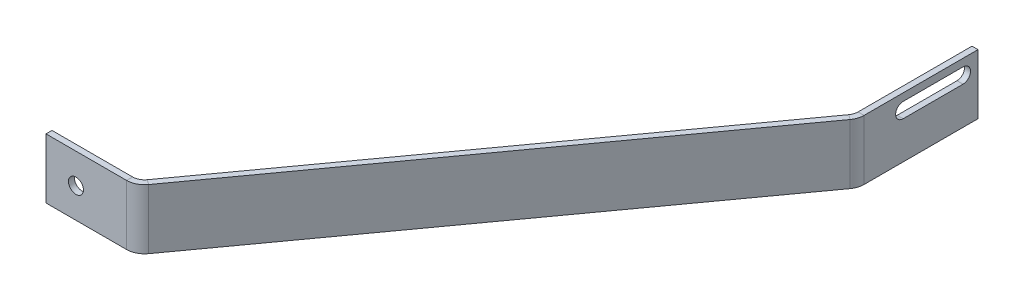
ISO-10303-21;
HEADER;
FILE_DESCRIPTION(('STEP AP214'),'2;1');
FILE_NAME('part.step','',(''),(''),'','','');
FILE_SCHEMA(('AUTOMOTIVE_DESIGN { 1 0 10303 214 1 1 1 1 }'));
ENDSEC;
DATA;
#1=APPLICATION_CONTEXT('core data for automotive mechanical design processes');
#2=APPLICATION_PROTOCOL_DEFINITION('international standard','automotive_design',2000,#1);
#3=PRODUCT_CONTEXT('',#1,'mechanical');
#4=PRODUCT('Part','Part','',(#3));
#5=PRODUCT_RELATED_PRODUCT_CATEGORY('part','',(#4));
#6=PRODUCT_DEFINITION_FORMATION('','',#4);
#7=PRODUCT_DEFINITION_CONTEXT('part definition',#1,'design');
#8=PRODUCT_DEFINITION('design','',#6,#7);
#9=PRODUCT_DEFINITION_SHAPE('','',#8);
#10=(LENGTH_UNIT() NAMED_UNIT(*) SI_UNIT(.MILLI.,.METRE.));
#11=(NAMED_UNIT(*) PLANE_ANGLE_UNIT() SI_UNIT($,.RADIAN.));
#12=(NAMED_UNIT(*) SI_UNIT($,.STERADIAN.) SOLID_ANGLE_UNIT());
#13=UNCERTAINTY_MEASURE_WITH_UNIT(LENGTH_MEASURE(1.E-05),#10,'distance_accuracy_value','');
#14=(GEOMETRIC_REPRESENTATION_CONTEXT(3) GLOBAL_UNCERTAINTY_ASSIGNED_CONTEXT((#13)) GLOBAL_UNIT_ASSIGNED_CONTEXT((#10,
#11,#12)) REPRESENTATION_CONTEXT('',''));
#15=CARTESIAN_POINT('',(0.,0.,0.));
#16=DIRECTION('',(0.,0.,1.));
#17=DIRECTION('',(1.,0.,0.));
#18=AXIS2_PLACEMENT_3D('',#15,#16,#17);
#19=CARTESIAN_POINT('',(131.25,20.,-140.));
#20=DIRECTION('',(-1.,0.,0.));
#21=DIRECTION('',(0.,0.,1.));
#22=AXIS2_PLACEMENT_3D('',#19,#20,#21);
#23=PLANE('',#22);
#24=DIRECTION('',(0.,0.,-1.));
#25=VECTOR('',#24,1.);
#26=CARTESIAN_POINT('',(131.25,20.,-140.));
#27=LINE('',#26,#25);
#28=CARTESIAN_POINT('',(131.25,20.,-141.94228428091));
#29=VERTEX_POINT('',#28);
#30=CARTESIAN_POINT('',(131.25,20.,-180.));
#31=VERTEX_POINT('',#30);
#32=EDGE_CURVE('E228',#29,#31,#27,.T.);
#33=ORIENTED_EDGE('',*,*,#32,.F.);
#34=DIRECTION('',(0.,-1.,0.));
#35=VECTOR('',#34,1.);
#36=CARTESIAN_POINT('',(131.25,20.,-141.94228428091));
#37=LINE('',#36,#35);
#38=CARTESIAN_POINT('',(131.25,0.,-141.94228428091));
#39=VERTEX_POINT('',#38);
#40=EDGE_CURVE('E240',#29,#39,#37,.T.);
#41=ORIENTED_EDGE('',*,*,#40,.T.);
#42=DIRECTION('',(0.,0.,-1.));
#43=VECTOR('',#42,1.);
#44=CARTESIAN_POINT('',(131.25,0.,-140.));
#45=LINE('',#44,#43);
#46=CARTESIAN_POINT('',(131.25,0.,-180.));
#47=VERTEX_POINT('',#46);
#48=EDGE_CURVE('E220',#39,#47,#45,.T.);
#49=ORIENTED_EDGE('',*,*,#48,.T.);
#50=DIRECTION('',(0.,-1.,0.));
#51=VECTOR('',#50,1.);
#52=CARTESIAN_POINT('',(131.25,20.,-180.));
#53=LINE('',#52,#51);
#54=EDGE_CURVE('E224',#31,#47,#53,.T.);
#55=ORIENTED_EDGE('',*,*,#54,.F.);
#56=EDGE_LOOP('',(#33,#41,#49,#55));
#57=FACE_BOUND('',#56,.T.);
#58=CARTESIAN_POINT('',(131.25,15.,-175.));
#59=DIRECTION('',(-1.,0.,0.));
#60=DIRECTION('',(0.,0.,1.));
#61=AXIS2_PLACEMENT_3D('',#58,#59,#60);
#62=CIRCLE('',#61,2.5);
#63=CARTESIAN_POINT('',(131.25,17.5,-175.));
#64=VERTEX_POINT('',#63);
#65=CARTESIAN_POINT('',(131.25,12.5,-175.));
#66=VERTEX_POINT('',#65);
#67=EDGE_CURVE('E63',#64,#66,#62,.T.);
#68=ORIENTED_EDGE('',*,*,#67,.T.);
#69=DIRECTION('',(0.,0.,1.));
#70=VECTOR('',#69,1.);
#71=CARTESIAN_POINT('',(131.25,12.5,-175.));
#72=LINE('',#71,#70);
#73=CARTESIAN_POINT('',(131.25,12.5,-155.));
#74=VERTEX_POINT('',#73);
#75=EDGE_CURVE('E170',#66,#74,#72,.T.);
#76=ORIENTED_EDGE('',*,*,#75,.T.);
#77=CARTESIAN_POINT('',(131.25,15.,-155.));
#78=DIRECTION('',(-1.,0.,0.));
#79=DIRECTION('',(0.,0.,1.));
#80=AXIS2_PLACEMENT_3D('',#77,#78,#79);
#81=CIRCLE('',#80,2.5);
#82=CARTESIAN_POINT('',(131.25,17.5,-155.));
#83=VERTEX_POINT('',#82);
#84=EDGE_CURVE('E177',#74,#83,#81,.T.);
#85=ORIENTED_EDGE('',*,*,#84,.T.);
#86=DIRECTION('',(0.,0.,-1.));
#87=VECTOR('',#86,1.);
#88=CARTESIAN_POINT('',(131.25,17.5,-175.));
#89=LINE('',#88,#87);
#90=EDGE_CURVE('E180',#83,#64,#89,.T.);
#91=ORIENTED_EDGE('',*,*,#90,.T.);
#92=EDGE_LOOP('',(#68,#76,#85,#91));
#93=FACE_BOUND('',#92,.T.);
#94=ADVANCED_FACE('F47',(#57,#93),#23,.F.);
#95=CARTESIAN_POINT('',(129.25,20.,-140.));
#96=DIRECTION('',(-1.,0.,0.));
#97=DIRECTION('',(0.,0.,1.));
#98=AXIS2_PLACEMENT_3D('',#95,#96,#97);
#99=PLANE('',#98);
#100=DIRECTION('',(0.,0.,1.));
#101=VECTOR('',#100,1.);
#102=CARTESIAN_POINT('',(129.25,20.,-140.));
#103=LINE('',#102,#101);
#104=CARTESIAN_POINT('',(129.25,20.,-141.94228428091));
#105=VERTEX_POINT('',#104);
#106=CARTESIAN_POINT('',(129.25,20.,-180.));
#107=VERTEX_POINT('',#106);
#108=EDGE_CURVE('E277',#105,#107,#103,.F.);
#109=ORIENTED_EDGE('',*,*,#108,.T.);
#110=DIRECTION('',(0.,1.,0.));
#111=VECTOR('',#110,1.);
#112=CARTESIAN_POINT('',(129.25,20.,-180.));
#113=LINE('',#112,#111);
#114=CARTESIAN_POINT('',(129.25,0.,-180.));
#115=VERTEX_POINT('',#114);
#116=EDGE_CURVE('E284',#107,#115,#113,.F.);
#117=ORIENTED_EDGE('',*,*,#116,.T.);
#118=DIRECTION('',(0.,0.,1.));
#119=VECTOR('',#118,1.);
#120=CARTESIAN_POINT('',(129.25,0.,-140.));
#121=LINE('',#120,#119);
#122=CARTESIAN_POINT('',(129.25,0.,-141.94228428091));
#123=VERTEX_POINT('',#122);
#124=EDGE_CURVE('E288',#123,#115,#121,.F.);
#125=ORIENTED_EDGE('',*,*,#124,.F.);
#126=DIRECTION('',(0.,1.,0.));
#127=VECTOR('',#126,1.);
#128=CARTESIAN_POINT('',(129.25,20.,-141.94228428091));
#129=LINE('',#128,#127);
#130=EDGE_CURVE('E265',#105,#123,#129,.F.);
#131=ORIENTED_EDGE('',*,*,#130,.F.);
#132=EDGE_LOOP('',(#109,#117,#125,#131));
#133=FACE_BOUND('',#132,.T.);
#134=DIRECTION('',(0.,0.,-1.));
#135=VECTOR('',#134,1.);
#136=CARTESIAN_POINT('',(129.25,12.5,-140.));
#137=LINE('',#136,#135);
#138=CARTESIAN_POINT('',(129.25,12.5,-155.));
#139=VERTEX_POINT('',#138);
#140=CARTESIAN_POINT('',(129.25,12.5,-175.));
#141=VERTEX_POINT('',#140);
#142=EDGE_CURVE('E56',#139,#141,#137,.T.);
#143=ORIENTED_EDGE('',*,*,#142,.T.);
#144=CARTESIAN_POINT('',(129.25,15.,-175.));
#145=DIRECTION('',(-1.,0.,0.));
#146=DIRECTION('',(0.,0.,1.));
#147=AXIS2_PLACEMENT_3D('',#144,#145,#146);
#148=CIRCLE('',#147,2.5);
#149=CARTESIAN_POINT('',(129.25,17.5,-175.));
#150=VERTEX_POINT('',#149);
#151=EDGE_CURVE('E11',#141,#150,#148,.F.);
#152=ORIENTED_EDGE('',*,*,#151,.T.);
#153=DIRECTION('',(0.,0.,1.));
#154=VECTOR('',#153,1.);
#155=CARTESIAN_POINT('',(129.25,17.5,-140.));
#156=LINE('',#155,#154);
#157=CARTESIAN_POINT('',(129.25,17.5,-155.));
#158=VERTEX_POINT('',#157);
#159=EDGE_CURVE('E361',#150,#158,#156,.T.);
#160=ORIENTED_EDGE('',*,*,#159,.T.);
#161=CARTESIAN_POINT('',(129.25,15.,-155.));
#162=DIRECTION('',(-1.,0.,0.));
#163=DIRECTION('',(0.,0.,1.));
#164=AXIS2_PLACEMENT_3D('',#161,#162,#163);
#165=CIRCLE('',#164,2.5);
#166=EDGE_CURVE('E370',#158,#139,#165,.F.);
#167=ORIENTED_EDGE('',*,*,#166,.T.);
#168=EDGE_LOOP('',(#143,#152,#160,#167));
#169=FACE_BOUND('',#168,.T.);
#170=ADVANCED_FACE('F375',(#133,#169),#99,.T.);
#171=CARTESIAN_POINT('',(30.,20.,0.));
#172=DIRECTION('',(0.,1.,0.));
#173=DIRECTION('',(0.586018731283682,0.,-0.810297504984844));
#174=AXIS2_PLACEMENT_3D('',#171,#172,#173);
#175=PLANE('',#174);
#176=DIRECTION('',(0.810297504984844,0.,0.586018731283682));
#177=VECTOR('',#176,1.);
#178=CARTESIAN_POINT('',(130.111785029909,20.,-138.426171893208));
#179=LINE('',#178,#177);
#180=CARTESIAN_POINT('',(128.491190019939,20.,-139.598209355775));
#181=VERTEX_POINT('',#180);
#182=CARTESIAN_POINT('',(130.111785029909,20.,-138.426171893208));
#183=VERTEX_POINT('',#182);
#184=EDGE_CURVE('E358',#181,#183,#179,.T.);
#185=ORIENTED_EDGE('',*,*,#184,.F.);
#186=DIRECTION('',(-0.586018731283682,0.,0.810297504984844));
#187=VECTOR('',#186,1.);
#188=CARTESIAN_POINT('',(28.3794049900303,20.,-1.17203746256736));
#189=LINE('',#188,#187);
#190=CARTESIAN_POINT('',(30.1757879953529,20.,-3.65592507486527));
#191=VERTEX_POINT('',#190);
#192=EDGE_CURVE('E302',#191,#181,#189,.F.);
#193=ORIENTED_EDGE('',*,*,#192,.F.);
#194=DIRECTION('',(0.810297504984844,0.,0.586018731283682));
#195=VECTOR('',#194,1.);
#196=CARTESIAN_POINT('',(31.7963830053226,20.,-2.48388761229791));
#197=LINE('',#196,#195);
#198=CARTESIAN_POINT('',(31.7963830053226,20.,-2.48388761229791));
#199=VERTEX_POINT('',#198);
#200=EDGE_CURVE('E355',#191,#199,#197,.T.);
#201=ORIENTED_EDGE('',*,*,#200,.T.);
#202=DIRECTION('',(0.586018731283682,0.,-0.810297504984844));
#203=VECTOR('',#202,1.);
#204=CARTESIAN_POINT('',(30.,20.,0.));
#205=LINE('',#204,#203);
#206=EDGE_CURVE('E203',#199,#183,#205,.T.);
#207=ORIENTED_EDGE('',*,*,#206,.T.);
#208=EDGE_LOOP('',(#185,#193,#201,#207));
#209=FACE_BOUND('',#208,.T.);
#210=ADVANCED_FACE('F392',(#209),#175,.T.);
#211=CARTESIAN_POINT('',(26.9345979754135,20.,-6.));
#212=DIRECTION('',(0.,-1.,0.));
#213=DIRECTION('',(0.,0.,-1.));
#214=AXIS2_PLACEMENT_3D('',#211,#212,#213);
#215=PLANE('',#214);
#216=ORIENTED_EDGE('',*,*,#200,.F.);
#217=CARTESIAN_POINT('',(26.9345979754135,20.,-6.));
#218=DIRECTION('',(0.,-1.,0.));
#219=DIRECTION('',(0.,0.,-1.));
#220=AXIS2_PLACEMENT_3D('',#217,#218,#219);
#221=CIRCLE('',#220,4.);
#222=CARTESIAN_POINT('',(26.9345979754135,20.,-2.));
#223=VERTEX_POINT('',#222);
#224=EDGE_CURVE('E303',#191,#223,#221,.T.);
#225=ORIENTED_EDGE('',*,*,#224,.T.);
#226=DIRECTION('',(0.,0.,1.));
#227=VECTOR('',#226,1.);
#228=CARTESIAN_POINT('',(26.9345979754135,20.,0.));
#229=LINE('',#228,#227);
#230=CARTESIAN_POINT('',(26.9345979754135,20.,0.));
#231=VERTEX_POINT('',#230);
#232=EDGE_CURVE('E352',#223,#231,#229,.T.);
#233=ORIENTED_EDGE('',*,*,#232,.T.);
#234=CARTESIAN_POINT('',(26.9345979754135,20.,-6.));
#235=DIRECTION('',(0.,1.,0.));
#236=DIRECTION('',(0.,0.,1.));
#237=AXIS2_PLACEMENT_3D('',#234,#235,#236);
#238=CIRCLE('',#237,6.);
#239=EDGE_CURVE('E204',#199,#231,#238,.F.);
#240=ORIENTED_EDGE('',*,*,#239,.F.);
#241=EDGE_LOOP('',(#216,#225,#233,#240));
#242=FACE_BOUND('',#241,.T.);
#243=ADVANCED_FACE('F461',(#242),#215,.F.);
#244=CARTESIAN_POINT('',(0.,20.,0.));
#245=DIRECTION('',(0.,1.,0.));
#246=DIRECTION('',(1.,0.,0.));
#247=AXIS2_PLACEMENT_3D('',#244,#245,#246);
#248=PLANE('',#247);
#249=ORIENTED_EDGE('',*,*,#232,.F.);
#250=DIRECTION('',(-1.,0.,0.));
#251=VECTOR('',#250,1.);
#252=CARTESIAN_POINT('',(0.,20.,-2.));
#253=LINE('',#252,#251);
#254=CARTESIAN_POINT('',(0.,20.,-2.));
#255=VERTEX_POINT('',#254);
#256=EDGE_CURVE('E312',#255,#223,#253,.F.);
#257=ORIENTED_EDGE('',*,*,#256,.F.);
#258=DIRECTION('',(0.,0.,1.));
#259=VECTOR('',#258,1.);
#260=CARTESIAN_POINT('',(0.,20.,0.));
#261=LINE('',#260,#259);
#262=CARTESIAN_POINT('',(0.,20.,0.));
#263=VERTEX_POINT('',#262);
#264=EDGE_CURVE('E349',#255,#263,#261,.T.);
#265=ORIENTED_EDGE('',*,*,#264,.T.);
#266=DIRECTION('',(1.,0.,0.));
#267=VECTOR('',#266,1.);
#268=CARTESIAN_POINT('',(0.,20.,0.));
#269=LINE('',#268,#267);
#270=EDGE_CURVE('E212',#263,#231,#269,.T.);
#271=ORIENTED_EDGE('',*,*,#270,.T.);
#272=EDGE_LOOP('',(#249,#257,#265,#271));
#273=FACE_BOUND('',#272,.T.);
#274=ADVANCED_FACE('F457',(#273),#248,.T.);
#275=CARTESIAN_POINT('',(0.,20.,0.));
#276=DIRECTION('',(1.,0.,0.));
#277=DIRECTION('',(0.,-1.,0.));
#278=AXIS2_PLACEMENT_3D('',#275,#276,#277);
#279=PLANE('',#278);
#280=ORIENTED_EDGE('',*,*,#264,.F.);
#281=DIRECTION('',(0.,1.,0.));
#282=VECTOR('',#281,1.);
#283=CARTESIAN_POINT('',(0.,20.,-2.));
#284=LINE('',#283,#282);
#285=CARTESIAN_POINT('',(0.,0.,-2.));
#286=VERTEX_POINT('',#285);
#287=EDGE_CURVE('E292',#255,#286,#284,.F.);
#288=ORIENTED_EDGE('',*,*,#287,.T.);
#289=DIRECTION('',(0.,0.,1.));
#290=VECTOR('',#289,1.);
#291=CARTESIAN_POINT('',(0.,0.,0.));
#292=LINE('',#291,#290);
#293=CARTESIAN_POINT('',(0.,0.,0.));
#294=VERTEX_POINT('',#293);
#295=EDGE_CURVE('E346',#286,#294,#292,.T.);
#296=ORIENTED_EDGE('',*,*,#295,.T.);
#297=DIRECTION('',(0.,-1.,0.));
#298=VECTOR('',#297,1.);
#299=CARTESIAN_POINT('',(0.,20.,0.));
#300=LINE('',#299,#298);
#301=EDGE_CURVE('E216',#263,#294,#300,.T.);
#302=ORIENTED_EDGE('',*,*,#301,.F.);
#303=EDGE_LOOP('',(#280,#288,#296,#302));
#304=FACE_BOUND('',#303,.T.);
#305=ADVANCED_FACE('F453',(#304),#279,.F.);
#306=CARTESIAN_POINT('',(0.,0.,0.));
#307=DIRECTION('',(0.,1.,0.));
#308=DIRECTION('',(1.,0.,0.));
#309=AXIS2_PLACEMENT_3D('',#306,#307,#308);
#310=PLANE('',#309);
#311=ORIENTED_EDGE('',*,*,#295,.F.);
#312=DIRECTION('',(-1.,0.,0.));
#313=VECTOR('',#312,1.);
#314=CARTESIAN_POINT('',(0.,0.,-2.));
#315=LINE('',#314,#313);
#316=CARTESIAN_POINT('',(26.9345979754135,0.,-2.));
#317=VERTEX_POINT('',#316);
#318=EDGE_CURVE('E308',#286,#317,#315,.F.);
#319=ORIENTED_EDGE('',*,*,#318,.T.);
#320=DIRECTION('',(0.,0.,1.));
#321=VECTOR('',#320,1.);
#322=CARTESIAN_POINT('',(26.9345979754135,0.,0.));
#323=LINE('',#322,#321);
#324=CARTESIAN_POINT('',(26.9345979754135,0.,0.));
#325=VERTEX_POINT('',#324);
#326=EDGE_CURVE('E343',#317,#325,#323,.T.);
#327=ORIENTED_EDGE('',*,*,#326,.T.);
#328=DIRECTION('',(1.,0.,0.));
#329=VECTOR('',#328,1.);
#330=CARTESIAN_POINT('',(0.,0.,0.));
#331=LINE('',#330,#329);
#332=EDGE_CURVE('E208',#294,#325,#331,.T.);
#333=ORIENTED_EDGE('',*,*,#332,.F.);
#334=EDGE_LOOP('',(#311,#319,#327,#333));
#335=FACE_BOUND('',#334,.T.);
#336=ADVANCED_FACE('F449',(#335),#310,.F.);
#337=CARTESIAN_POINT('',(26.9345979754135,0.,-6.));
#338=DIRECTION('',(0.,1.,0.));
#339=DIRECTION('',(0.,0.,1.));
#340=AXIS2_PLACEMENT_3D('',#337,#338,#339);
#341=PLANE('',#340);
#342=ORIENTED_EDGE('',*,*,#326,.F.);
#343=CARTESIAN_POINT('',(26.9345979754135,0.,-6.));
#344=DIRECTION('',(0.,-1.,0.));
#345=DIRECTION('',(0.,0.,-1.));
#346=AXIS2_PLACEMENT_3D('',#343,#344,#345);
#347=CIRCLE('',#346,4.);
#348=CARTESIAN_POINT('',(30.1757879953529,0.,-3.65592507486527));
#349=VERTEX_POINT('',#348);
#350=EDGE_CURVE('E304',#317,#349,#347,.F.);
#351=ORIENTED_EDGE('',*,*,#350,.T.);
#352=DIRECTION('',(0.810297504984844,0.,0.586018731283682));
#353=VECTOR('',#352,1.);
#354=CARTESIAN_POINT('',(31.7963830053226,0.,-2.48388761229791));
#355=LINE('',#354,#353);
#356=CARTESIAN_POINT('',(31.7963830053226,0.,-2.48388761229791));
#357=VERTEX_POINT('',#356);
#358=EDGE_CURVE('E340',#349,#357,#355,.T.);
#359=ORIENTED_EDGE('',*,*,#358,.T.);
#360=CARTESIAN_POINT('',(26.9345979754135,0.,-6.));
#361=DIRECTION('',(0.,-1.,0.));
#362=DIRECTION('',(0.,0.,-1.));
#363=AXIS2_PLACEMENT_3D('',#360,#361,#362);
#364=CIRCLE('',#363,6.);
#365=EDGE_CURVE('E241',#325,#357,#364,.F.);
#366=ORIENTED_EDGE('',*,*,#365,.F.);
#367=EDGE_LOOP('',(#342,#351,#359,#366));
#368=FACE_BOUND('',#367,.T.);
#369=ADVANCED_FACE('F445',(#368),#341,.F.);
#370=CARTESIAN_POINT('',(30.,0.,0.));
#371=DIRECTION('',(0.,1.,0.));
#372=DIRECTION('',(0.586018731283682,0.,-0.810297504984844));
#373=AXIS2_PLACEMENT_3D('',#370,#371,#372);
#374=PLANE('',#373);
#375=ORIENTED_EDGE('',*,*,#358,.F.);
#376=DIRECTION('',(-0.586018731283682,0.,0.810297504984844));
#377=VECTOR('',#376,1.);
#378=CARTESIAN_POINT('',(28.3794049900303,0.,-1.17203746256736));
#379=LINE('',#378,#377);
#380=CARTESIAN_POINT('',(128.491190019939,0.,-139.598209355775));
#381=VERTEX_POINT('',#380);
#382=EDGE_CURVE('E298',#349,#381,#379,.F.);
#383=ORIENTED_EDGE('',*,*,#382,.T.);
#384=DIRECTION('',(0.810297504984846,0.,0.586018731283679));
#385=VECTOR('',#384,1.);
#386=CARTESIAN_POINT('',(130.111785029909,0.,-138.426171893208));
#387=LINE('',#386,#385);
#388=CARTESIAN_POINT('',(130.111785029909,0.,-138.426171893208));
#389=VERTEX_POINT('',#388);
#390=EDGE_CURVE('E337',#381,#389,#387,.T.);
#391=ORIENTED_EDGE('',*,*,#390,.T.);
#392=DIRECTION('',(0.586018731283682,0.,-0.810297504984844));
#393=VECTOR('',#392,1.);
#394=CARTESIAN_POINT('',(30.,0.,0.));
#395=LINE('',#394,#393);
#396=EDGE_CURVE('E199',#357,#389,#395,.T.);
#397=ORIENTED_EDGE('',*,*,#396,.F.);
#398=EDGE_LOOP('',(#375,#383,#391,#397));
#399=FACE_BOUND('',#398,.T.);
#400=ADVANCED_FACE('F441',(#399),#374,.F.);
#401=CARTESIAN_POINT('',(125.25,0.,-141.94228428091));
#402=DIRECTION('',(0.,1.,0.));
#403=DIRECTION('',(0.,0.,1.));
#404=AXIS2_PLACEMENT_3D('',#401,#402,#403);
#405=PLANE('',#404);
#406=ORIENTED_EDGE('',*,*,#390,.F.);
#407=CARTESIAN_POINT('',(125.25,0.,-141.94228428091));
#408=DIRECTION('',(0.,-1.,0.));
#409=DIRECTION('',(0.,0.,-1.));
#410=AXIS2_PLACEMENT_3D('',#407,#408,#409);
#411=CIRCLE('',#410,4.);
#412=EDGE_CURVE('E293',#381,#123,#411,.F.);
#413=ORIENTED_EDGE('',*,*,#412,.T.);
#414=DIRECTION('',(1.,0.,0.));
#415=VECTOR('',#414,1.);
#416=CARTESIAN_POINT('',(131.25,0.,-141.94228428091));
#417=LINE('',#416,#415);
#418=EDGE_CURVE('E334',#123,#39,#417,.T.);
#419=ORIENTED_EDGE('',*,*,#418,.T.);
#420=CARTESIAN_POINT('',(125.25,0.,-141.94228428091));
#421=DIRECTION('',(0.,-1.,0.));
#422=DIRECTION('',(0.,0.,-1.));
#423=AXIS2_PLACEMENT_3D('',#420,#421,#422);
#424=CIRCLE('',#423,6.);
#425=EDGE_CURVE('E257',#389,#39,#424,.F.);
#426=ORIENTED_EDGE('',*,*,#425,.F.);
#427=EDGE_LOOP('',(#406,#413,#419,#426));
#428=FACE_BOUND('',#427,.T.);
#429=ADVANCED_FACE('F437',(#428),#405,.F.);
#430=CARTESIAN_POINT('',(131.25,0.,-140.));
#431=DIRECTION('',(0.,1.,0.));
#432=DIRECTION('',(0.,0.,-1.));
#433=AXIS2_PLACEMENT_3D('',#430,#431,#432);
#434=PLANE('',#433);
#435=ORIENTED_EDGE('',*,*,#418,.F.);
#436=ORIENTED_EDGE('',*,*,#124,.T.);
#437=DIRECTION('',(1.,0.,0.));
#438=VECTOR('',#437,1.);
#439=CARTESIAN_POINT('',(131.25,0.,-180.));
#440=LINE('',#439,#438);
#441=EDGE_CURVE('E331',#115,#47,#440,.T.);
#442=ORIENTED_EDGE('',*,*,#441,.T.);
#443=ORIENTED_EDGE('',*,*,#48,.F.);
#444=EDGE_LOOP('',(#435,#436,#442,#443));
#445=FACE_BOUND('',#444,.T.);
#446=ADVANCED_FACE('F433',(#445),#434,.F.);
#447=CARTESIAN_POINT('',(131.25,20.,-180.));
#448=DIRECTION('',(0.,0.,-1.));
#449=DIRECTION('',(0.,-1.,0.));
#450=AXIS2_PLACEMENT_3D('',#447,#448,#449);
#451=PLANE('',#450);
#452=ORIENTED_EDGE('',*,*,#441,.F.);
#453=ORIENTED_EDGE('',*,*,#116,.F.);
#454=DIRECTION('',(1.,0.,0.));
#455=VECTOR('',#454,1.);
#456=CARTESIAN_POINT('',(131.25,20.,-180.));
#457=LINE('',#456,#455);
#458=EDGE_CURVE('E328',#107,#31,#457,.T.);
#459=ORIENTED_EDGE('',*,*,#458,.T.);
#460=ORIENTED_EDGE('',*,*,#54,.T.);
#461=EDGE_LOOP('',(#452,#453,#459,#460));
#462=FACE_BOUND('',#461,.T.);
#463=ADVANCED_FACE('F429',(#462),#451,.T.);
#464=CARTESIAN_POINT('',(131.25,20.,-140.));
#465=DIRECTION('',(0.,1.,0.));
#466=DIRECTION('',(0.,0.,-1.));
#467=AXIS2_PLACEMENT_3D('',#464,#465,#466);
#468=PLANE('',#467);
#469=ORIENTED_EDGE('',*,*,#458,.F.);
#470=ORIENTED_EDGE('',*,*,#108,.F.);
#471=DIRECTION('',(1.,0.,0.));
#472=VECTOR('',#471,1.);
#473=CARTESIAN_POINT('',(131.25,20.,-141.94228428091));
#474=LINE('',#473,#472);
#475=EDGE_CURVE('E256',#105,#29,#474,.T.);
#476=ORIENTED_EDGE('',*,*,#475,.T.);
#477=ORIENTED_EDGE('',*,*,#32,.T.);
#478=EDGE_LOOP('',(#469,#470,#476,#477));
#479=FACE_BOUND('',#478,.T.);
#480=ADVANCED_FACE('F426',(#479),#468,.T.);
#481=CARTESIAN_POINT('',(125.25,20.,-141.94228428091));
#482=DIRECTION('',(0.,-1.,0.));
#483=DIRECTION('',(0.,0.,-1.));
#484=AXIS2_PLACEMENT_3D('',#481,#482,#483);
#485=PLANE('',#484);
#486=CARTESIAN_POINT('',(125.25,20.,-141.94228428091));
#487=DIRECTION('',(0.,-1.,0.));
#488=DIRECTION('',(0.,0.,-1.));
#489=AXIS2_PLACEMENT_3D('',#486,#487,#488);
#490=CIRCLE('',#489,4.);
#491=EDGE_CURVE('E297',#105,#181,#490,.T.);
#492=ORIENTED_EDGE('',*,*,#491,.T.);
#493=ORIENTED_EDGE('',*,*,#184,.T.);
#494=CARTESIAN_POINT('',(125.25,20.,-141.94228428091));
#495=DIRECTION('',(0.,1.,0.));
#496=DIRECTION('',(0.,0.,1.));
#497=AXIS2_PLACEMENT_3D('',#494,#495,#496);
#498=CIRCLE('',#497,6.);
#499=EDGE_CURVE('E245',#29,#183,#498,.F.);
#500=ORIENTED_EDGE('',*,*,#499,.F.);
#501=ORIENTED_EDGE('',*,*,#475,.F.);
#502=EDGE_LOOP('',(#492,#493,#500,#501));
#503=FACE_BOUND('',#502,.T.);
#504=ADVANCED_FACE('F49',(#503),#485,.F.);
#505=CARTESIAN_POINT('',(0.,20.,0.));
#506=DIRECTION('',(0.,0.,-1.));
#507=DIRECTION('',(-1.,0.,0.));
#508=AXIS2_PLACEMENT_3D('',#505,#506,#507);
#509=PLANE('',#508);
#510=CARTESIAN_POINT('',(10.,10.,0.));
#511=DIRECTION('',(0.,0.,1.));
#512=DIRECTION('',(1.,0.,0.));
#513=AXIS2_PLACEMENT_3D('',#510,#511,#512);
#514=CIRCLE('',#513,2.5);
#515=CARTESIAN_POINT('',(12.5,10.,0.));
#516=VERTEX_POINT('',#515);
#517=EDGE_CURVE('E166',#516,#516,#514,.T.);
#518=ORIENTED_EDGE('',*,*,#517,.F.);
#519=EDGE_LOOP('',(#518));
#520=FACE_BOUND('',#519,.T.);
#521=ORIENTED_EDGE('',*,*,#332,.T.);
#522=DIRECTION('',(0.,-1.,0.));
#523=VECTOR('',#522,1.);
#524=CARTESIAN_POINT('',(26.9345979754135,20.,0.));
#525=LINE('',#524,#523);
#526=EDGE_CURVE('E236',#325,#231,#525,.F.);
#527=ORIENTED_EDGE('',*,*,#526,.T.);
#528=ORIENTED_EDGE('',*,*,#270,.F.);
#529=ORIENTED_EDGE('',*,*,#301,.T.);
#530=EDGE_LOOP('',(#521,#527,#528,#529));
#531=FACE_BOUND('',#530,.T.);
#532=ADVANCED_FACE('F398',(#520,#531),#509,.F.);
#533=CARTESIAN_POINT('',(30.,20.,0.));
#534=DIRECTION('',(-0.810297504984844,0.,-0.586018731283682));
#535=DIRECTION('',(-0.586018731283682,0.,0.810297504984844));
#536=AXIS2_PLACEMENT_3D('',#533,#534,#535);
#537=PLANE('',#536);
#538=ORIENTED_EDGE('',*,*,#396,.T.);
#539=DIRECTION('',(0.,-1.,0.));
#540=VECTOR('',#539,1.);
#541=CARTESIAN_POINT('',(130.111785029909,20.,-138.426171893208));
#542=LINE('',#541,#540);
#543=EDGE_CURVE('E252',#389,#183,#542,.F.);
#544=ORIENTED_EDGE('',*,*,#543,.T.);
#545=ORIENTED_EDGE('',*,*,#206,.F.);
#546=DIRECTION('',(0.,-1.,0.));
#547=VECTOR('',#546,1.);
#548=CARTESIAN_POINT('',(31.7963830053226,20.,-2.48388761229791));
#549=LINE('',#548,#547);
#550=EDGE_CURVE('E232',#199,#357,#549,.T.);
#551=ORIENTED_EDGE('',*,*,#550,.T.);
#552=EDGE_LOOP('',(#538,#544,#545,#551));
#553=FACE_BOUND('',#552,.T.);
#554=ADVANCED_FACE('F404',(#553),#537,.F.);
#555=CARTESIAN_POINT('',(26.9345979754135,20.,-6.));
#556=DIRECTION('',(0.,-1.,0.));
#557=DIRECTION('',(0.,0.,-1.));
#558=AXIS2_PLACEMENT_3D('',#555,#556,#557);
#559=CYLINDRICAL_SURFACE('',#558,6.);
#560=ORIENTED_EDGE('',*,*,#239,.T.);
#561=ORIENTED_EDGE('',*,*,#526,.F.);
#562=ORIENTED_EDGE('',*,*,#365,.T.);
#563=ORIENTED_EDGE('',*,*,#550,.F.);
#564=EDGE_LOOP('',(#560,#561,#562,#563));
#565=FACE_BOUND('',#564,.T.);
#566=ADVANCED_FACE('F400',(#565),#559,.T.);
#567=CARTESIAN_POINT('',(125.25,20.,-141.94228428091));
#568=DIRECTION('',(0.,-1.,0.));
#569=DIRECTION('',(0.,0.,-1.));
#570=AXIS2_PLACEMENT_3D('',#567,#568,#569);
#571=CYLINDRICAL_SURFACE('',#570,6.);
#572=ORIENTED_EDGE('',*,*,#499,.T.);
#573=ORIENTED_EDGE('',*,*,#543,.F.);
#574=ORIENTED_EDGE('',*,*,#425,.T.);
#575=ORIENTED_EDGE('',*,*,#40,.F.);
#576=EDGE_LOOP('',(#572,#573,#574,#575));
#577=FACE_BOUND('',#576,.T.);
#578=ADVANCED_FACE('F403',(#577),#571,.T.);
#579=CARTESIAN_POINT('',(0.,20.,-2.));
#580=DIRECTION('',(0.,0.,-1.));
#581=DIRECTION('',(-1.,0.,0.));
#582=AXIS2_PLACEMENT_3D('',#579,#580,#581);
#583=PLANE('',#582);
#584=CARTESIAN_POINT('',(10.,10.,-2.));
#585=DIRECTION('',(0.,0.,-1.));
#586=DIRECTION('',(-1.,0.,0.));
#587=AXIS2_PLACEMENT_3D('',#584,#585,#586);
#588=CIRCLE('',#587,2.5);
#589=CARTESIAN_POINT('',(7.5,10.,-2.));
#590=VERTEX_POINT('',#589);
#591=EDGE_CURVE('E198',#590,#590,#588,.T.);
#592=ORIENTED_EDGE('',*,*,#591,.F.);
#593=EDGE_LOOP('',(#592));
#594=FACE_BOUND('',#593,.T.);
#595=ORIENTED_EDGE('',*,*,#318,.F.);
#596=ORIENTED_EDGE('',*,*,#287,.F.);
#597=ORIENTED_EDGE('',*,*,#256,.T.);
#598=DIRECTION('',(0.,1.,0.));
#599=VECTOR('',#598,1.);
#600=CARTESIAN_POINT('',(26.9345979754135,20.,-2.));
#601=LINE('',#600,#599);
#602=EDGE_CURVE('E269',#317,#223,#601,.T.);
#603=ORIENTED_EDGE('',*,*,#602,.F.);
#604=EDGE_LOOP('',(#595,#596,#597,#603));
#605=FACE_BOUND('',#604,.T.);
#606=ADVANCED_FACE('F407',(#594,#605),#583,.T.);
#607=CARTESIAN_POINT('',(28.3794049900303,20.,-1.17203746256736));
#608=DIRECTION('',(-0.810297504984844,0.,-0.586018731283682));
#609=DIRECTION('',(-0.586018731283682,0.,0.810297504984844));
#610=AXIS2_PLACEMENT_3D('',#607,#608,#609);
#611=PLANE('',#610);
#612=ORIENTED_EDGE('',*,*,#382,.F.);
#613=DIRECTION('',(0.,1.,0.));
#614=VECTOR('',#613,1.);
#615=CARTESIAN_POINT('',(30.1757879953529,20.,-3.65592507486527));
#616=LINE('',#615,#614);
#617=EDGE_CURVE('E273',#191,#349,#616,.F.);
#618=ORIENTED_EDGE('',*,*,#617,.F.);
#619=ORIENTED_EDGE('',*,*,#192,.T.);
#620=DIRECTION('',(0.,1.,0.));
#621=VECTOR('',#620,1.);
#622=CARTESIAN_POINT('',(128.491190019939,20.,-139.598209355775));
#623=LINE('',#622,#621);
#624=EDGE_CURVE('E261',#381,#181,#623,.T.);
#625=ORIENTED_EDGE('',*,*,#624,.F.);
#626=EDGE_LOOP('',(#612,#618,#619,#625));
#627=FACE_BOUND('',#626,.T.);
#628=ADVANCED_FACE('F412',(#627),#611,.T.);
#629=CARTESIAN_POINT('',(26.9345979754135,20.,-6.));
#630=DIRECTION('',(0.,-1.,0.));
#631=DIRECTION('',(0.,0.,-1.));
#632=AXIS2_PLACEMENT_3D('',#629,#630,#631);
#633=CYLINDRICAL_SURFACE('',#632,4.);
#634=ORIENTED_EDGE('',*,*,#224,.F.);
#635=ORIENTED_EDGE('',*,*,#617,.T.);
#636=ORIENTED_EDGE('',*,*,#350,.F.);
#637=ORIENTED_EDGE('',*,*,#602,.T.);
#638=EDGE_LOOP('',(#634,#635,#636,#637));
#639=FACE_BOUND('',#638,.T.);
#640=ADVANCED_FACE('F416',(#639),#633,.F.);
#641=CARTESIAN_POINT('',(125.25,20.,-141.94228428091));
#642=DIRECTION('',(0.,-1.,0.));
#643=DIRECTION('',(0.,0.,-1.));
#644=AXIS2_PLACEMENT_3D('',#641,#642,#643);
#645=CYLINDRICAL_SURFACE('',#644,4.);
#646=ORIENTED_EDGE('',*,*,#491,.F.);
#647=ORIENTED_EDGE('',*,*,#130,.T.);
#648=ORIENTED_EDGE('',*,*,#412,.F.);
#649=ORIENTED_EDGE('',*,*,#624,.T.);
#650=EDGE_LOOP('',(#646,#647,#648,#649));
#651=FACE_BOUND('',#650,.T.);
#652=ADVANCED_FACE('F420',(#651),#645,.F.);
#653=CARTESIAN_POINT('',(10.,10.,-20.));
#654=DIRECTION('',(0.,0.,1.));
#655=DIRECTION('',(1.,0.,0.));
#656=AXIS2_PLACEMENT_3D('',#653,#654,#655);
#657=CYLINDRICAL_SURFACE('',#656,2.5);
#658=ORIENTED_EDGE('',*,*,#591,.T.);
#659=EDGE_LOOP('',(#658));
#660=FACE_BOUND('',#659,.T.);
#661=ORIENTED_EDGE('',*,*,#517,.T.);
#662=EDGE_LOOP('',(#661));
#663=FACE_BOUND('',#662,.T.);
#664=ADVANCED_FACE('F424',(#660,#663),#657,.F.);
#665=CARTESIAN_POINT('',(121.25,15.,-175.));
#666=DIRECTION('',(1.,0.,0.));
#667=DIRECTION('',(0.,0.,-1.));
#668=AXIS2_PLACEMENT_3D('',#665,#666,#667);
#669=CYLINDRICAL_SURFACE('',#668,2.5);
#670=DIRECTION('',(1.,0.,0.));
#671=VECTOR('',#670,1.);
#672=CARTESIAN_POINT('',(121.25,12.5,-175.));
#673=LINE('',#672,#671);
#674=EDGE_CURVE('E160',#141,#66,#673,.T.);
#675=ORIENTED_EDGE('',*,*,#674,.T.);
#676=ORIENTED_EDGE('',*,*,#67,.F.);
#677=DIRECTION('',(1.,0.,0.));
#678=VECTOR('',#677,1.);
#679=CARTESIAN_POINT('',(121.25,17.5,-175.));
#680=LINE('',#679,#678);
#681=EDGE_CURVE('E188',#150,#64,#680,.T.);
#682=ORIENTED_EDGE('',*,*,#681,.F.);
#683=ORIENTED_EDGE('',*,*,#151,.F.);
#684=EDGE_LOOP('',(#675,#676,#682,#683));
#685=FACE_BOUND('',#684,.T.);
#686=ADVANCED_FACE('F162',(#685),#669,.F.);
#687=CARTESIAN_POINT('',(121.25,12.5,-175.));
#688=DIRECTION('',(0.,1.,0.));
#689=DIRECTION('',(0.,0.,1.));
#690=AXIS2_PLACEMENT_3D('',#687,#688,#689);
#691=PLANE('',#690);
#692=DIRECTION('',(1.,0.,0.));
#693=VECTOR('',#692,1.);
#694=CARTESIAN_POINT('',(121.25,12.5,-155.));
#695=LINE('',#694,#693);
#696=EDGE_CURVE('E167',#139,#74,#695,.T.);
#697=ORIENTED_EDGE('',*,*,#696,.T.);
#698=ORIENTED_EDGE('',*,*,#75,.F.);
#699=ORIENTED_EDGE('',*,*,#674,.F.);
#700=ORIENTED_EDGE('',*,*,#142,.F.);
#701=EDGE_LOOP('',(#697,#698,#699,#700));
#702=FACE_BOUND('',#701,.T.);
#703=ADVANCED_FACE('F171',(#702),#691,.T.);
#704=CARTESIAN_POINT('',(121.25,15.,-155.));
#705=DIRECTION('',(1.,0.,0.));
#706=DIRECTION('',(0.,0.,-1.));
#707=AXIS2_PLACEMENT_3D('',#704,#705,#706);
#708=CYLINDRICAL_SURFACE('',#707,2.5);
#709=DIRECTION('',(1.,0.,0.));
#710=VECTOR('',#709,1.);
#711=CARTESIAN_POINT('',(121.25,17.5,-155.));
#712=LINE('',#711,#710);
#713=EDGE_CURVE('E71',#158,#83,#712,.T.);
#714=ORIENTED_EDGE('',*,*,#713,.T.);
#715=ORIENTED_EDGE('',*,*,#84,.F.);
#716=ORIENTED_EDGE('',*,*,#696,.F.);
#717=ORIENTED_EDGE('',*,*,#166,.F.);
#718=EDGE_LOOP('',(#714,#715,#716,#717));
#719=FACE_BOUND('',#718,.T.);
#720=ADVANCED_FACE('F377',(#719),#708,.F.);
#721=CARTESIAN_POINT('',(121.25,17.5,-175.));
#722=DIRECTION('',(0.,-1.,0.));
#723=DIRECTION('',(0.,0.,-1.));
#724=AXIS2_PLACEMENT_3D('',#721,#722,#723);
#725=PLANE('',#724);
#726=ORIENTED_EDGE('',*,*,#681,.T.);
#727=ORIENTED_EDGE('',*,*,#90,.F.);
#728=ORIENTED_EDGE('',*,*,#713,.F.);
#729=ORIENTED_EDGE('',*,*,#159,.F.);
#730=EDGE_LOOP('',(#726,#727,#728,#729));
#731=FACE_BOUND('',#730,.T.);
#732=ADVANCED_FACE('F378',(#731),#725,.T.);
#733=CLOSED_SHELL('',(#94,#170,#210,#243,#274,#305,#336,#369,#400,#429,#446,#463,#480,#504,#532,
#554,#566,#578,#606,#628,#640,#652,#664,#686,#703,#720,#732));
#734=MANIFOLD_SOLID_BREP('B2',#733);
#735=ADVANCED_BREP_SHAPE_REPRESENTATION('',(#18,#734),#14);
#736=SHAPE_DEFINITION_REPRESENTATION(#9,#735);
ENDSEC;
END-ISO-10303-21;
